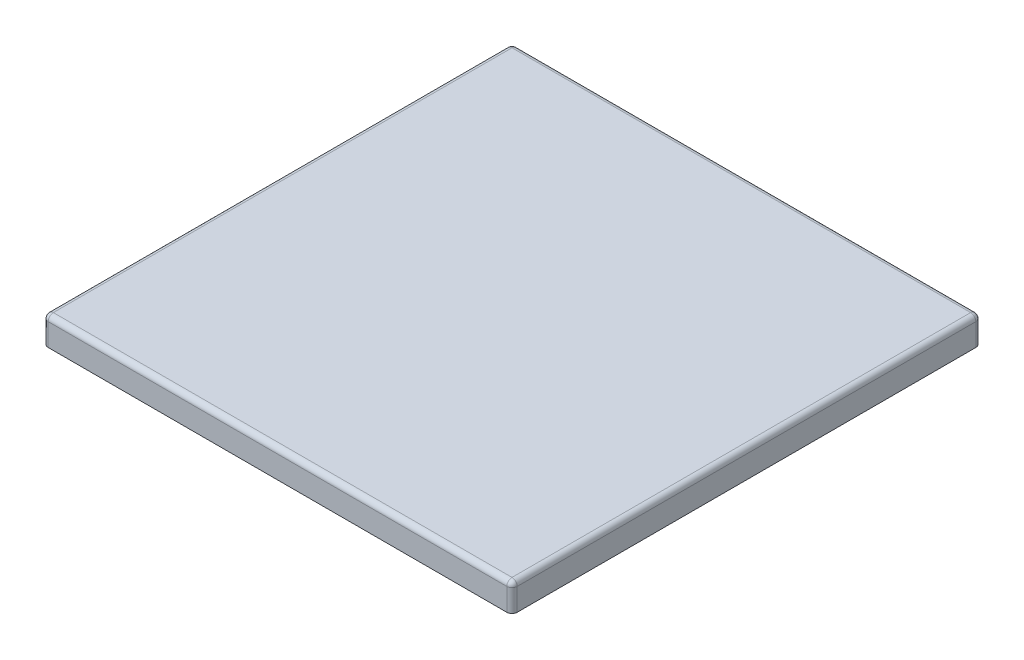
ISO-10303-21;
HEADER;
FILE_DESCRIPTION(('STEP AP214'),'2;1');
FILE_NAME('part.step','',(''),(''),'','','');
FILE_SCHEMA(('AUTOMOTIVE_DESIGN { 1 0 10303 214 1 1 1 1 }'));
ENDSEC;
DATA;
#1=APPLICATION_CONTEXT('core data for automotive mechanical design processes');
#2=APPLICATION_PROTOCOL_DEFINITION('international standard','automotive_design',2000,#1);
#3=PRODUCT_CONTEXT('',#1,'mechanical');
#4=PRODUCT('Part','Part','',(#3));
#5=PRODUCT_RELATED_PRODUCT_CATEGORY('part','',(#4));
#6=PRODUCT_DEFINITION_FORMATION('','',#4);
#7=PRODUCT_DEFINITION_CONTEXT('part definition',#1,'design');
#8=PRODUCT_DEFINITION('design','',#6,#7);
#9=PRODUCT_DEFINITION_SHAPE('','',#8);
#10=(LENGTH_UNIT() NAMED_UNIT(*) SI_UNIT(.MILLI.,.METRE.));
#11=(NAMED_UNIT(*) PLANE_ANGLE_UNIT() SI_UNIT($,.RADIAN.));
#12=(NAMED_UNIT(*) SI_UNIT($,.STERADIAN.) SOLID_ANGLE_UNIT());
#13=UNCERTAINTY_MEASURE_WITH_UNIT(LENGTH_MEASURE(1.E-05),#10,'distance_accuracy_value','');
#14=(GEOMETRIC_REPRESENTATION_CONTEXT(3) GLOBAL_UNCERTAINTY_ASSIGNED_CONTEXT((#13)) GLOBAL_UNIT_ASSIGNED_CONTEXT((#10,
#11,#12)) REPRESENTATION_CONTEXT('',''));
#15=CARTESIAN_POINT('',(0.,0.,0.));
#16=DIRECTION('',(0.,0.,1.));
#17=DIRECTION('',(1.,0.,0.));
#18=AXIS2_PLACEMENT_3D('',#15,#16,#17);
#19=CARTESIAN_POINT('',(0.,-3.3,0.));
#20=DIRECTION('',(0.,-1.,0.));
#21=DIRECTION('',(0.,0.,-1.));
#22=AXIS2_PLACEMENT_3D('',#19,#20,#21);
#23=PLANE('',#22);
#24=CARTESIAN_POINT('',(22.6,-3.3,22.4));
#25=DIRECTION('',(0.,-1.,0.));
#26=DIRECTION('',(0.,0.,-1.));
#27=AXIS2_PLACEMENT_3D('',#24,#25,#26);
#28=CIRCLE('',#27,6.1);
#29=CARTESIAN_POINT('',(22.6,-3.3,16.3));
#30=VERTEX_POINT('',#29);
#31=EDGE_CURVE('E438',#30,#30,#28,.T.);
#32=ORIENTED_EDGE('',*,*,#31,.F.);
#33=EDGE_LOOP('',(#32));
#34=FACE_BOUND('',#33,.T.);
#35=CARTESIAN_POINT('',(-22.4,-3.3,22.4));
#36=DIRECTION('',(0.,-1.,0.));
#37=DIRECTION('',(0.,0.,-1.));
#38=AXIS2_PLACEMENT_3D('',#35,#36,#37);
#39=CIRCLE('',#38,6.1);
#40=CARTESIAN_POINT('',(-22.4,-3.3,16.3));
#41=VERTEX_POINT('',#40);
#42=EDGE_CURVE('E147',#41,#41,#39,.T.);
#43=ORIENTED_EDGE('',*,*,#42,.F.);
#44=EDGE_LOOP('',(#43));
#45=FACE_BOUND('',#44,.T.);
#46=DIRECTION('',(0.,0.,-1.));
#47=VECTOR('',#46,1.);
#48=CARTESIAN_POINT('',(-43.,-3.3,43.));
#49=LINE('',#48,#47);
#50=CARTESIAN_POINT('',(-43.,-3.3,43.));
#51=VERTEX_POINT('',#50);
#52=CARTESIAN_POINT('',(-43.,-3.3,-43.));
#53=VERTEX_POINT('',#52);
#54=EDGE_CURVE('E121',#51,#53,#49,.T.);
#55=ORIENTED_EDGE('',*,*,#54,.T.);
#56=DIRECTION('',(1.,0.,0.));
#57=VECTOR('',#56,1.);
#58=CARTESIAN_POINT('',(-43.,-3.3,-43.));
#59=LINE('',#58,#57);
#60=CARTESIAN_POINT('',(43.,-3.3,-43.));
#61=VERTEX_POINT('',#60);
#62=EDGE_CURVE('E132',#53,#61,#59,.T.);
#63=ORIENTED_EDGE('',*,*,#62,.T.);
#64=DIRECTION('',(0.,0.,1.));
#65=VECTOR('',#64,1.);
#66=CARTESIAN_POINT('',(43.,-3.3,43.));
#67=LINE('',#66,#65);
#68=CARTESIAN_POINT('',(43.,-3.3,43.));
#69=VERTEX_POINT('',#68);
#70=EDGE_CURVE('E137',#61,#69,#67,.T.);
#71=ORIENTED_EDGE('',*,*,#70,.T.);
#72=DIRECTION('',(-1.,0.,0.));
#73=VECTOR('',#72,1.);
#74=CARTESIAN_POINT('',(-43.,-3.3,43.));
#75=LINE('',#74,#73);
#76=EDGE_CURVE('E129',#69,#51,#75,.T.);
#77=ORIENTED_EDGE('',*,*,#76,.T.);
#78=EDGE_LOOP('',(#55,#63,#71,#77));
#79=FACE_BOUND('',#78,.T.);
#80=CARTESIAN_POINT('',(-22.4,-3.3,-22.6));
#81=DIRECTION('',(0.,-1.,0.));
#82=DIRECTION('',(0.,0.,-1.));
#83=AXIS2_PLACEMENT_3D('',#80,#81,#82);
#84=CIRCLE('',#83,6.1);
#85=CARTESIAN_POINT('',(-22.4,-3.3,-28.7));
#86=VERTEX_POINT('',#85);
#87=EDGE_CURVE('E434',#86,#86,#84,.T.);
#88=ORIENTED_EDGE('',*,*,#87,.F.);
#89=EDGE_LOOP('',(#88));
#90=FACE_BOUND('',#89,.T.);
#91=CARTESIAN_POINT('',(22.6,-3.3,-22.6));
#92=DIRECTION('',(0.,-1.,0.));
#93=DIRECTION('',(0.,0.,-1.));
#94=AXIS2_PLACEMENT_3D('',#91,#92,#93);
#95=CIRCLE('',#94,6.1);
#96=CARTESIAN_POINT('',(22.6,-3.3,-28.7));
#97=VERTEX_POINT('',#96);
#98=EDGE_CURVE('E443',#97,#97,#95,.T.);
#99=ORIENTED_EDGE('',*,*,#98,.F.);
#100=EDGE_LOOP('',(#99));
#101=FACE_BOUND('',#100,.T.);
#102=ADVANCED_FACE('F16',(#34,#45,#79,#90,#101),#23,.T.);
#103=CARTESIAN_POINT('',(-45.,-5.3,-45.));
#104=DIRECTION('',(-1.,0.,0.));
#105=DIRECTION('',(0.,0.,1.));
#106=AXIS2_PLACEMENT_3D('',#103,#104,#105);
#107=PLANE('',#106);
#108=DIRECTION('',(0.,0.,1.));
#109=VECTOR('',#108,1.);
#110=CARTESIAN_POINT('',(-45.,-1.,-45.));
#111=LINE('',#110,#109);
#112=CARTESIAN_POINT('',(-45.,-1.,44.));
#113=VERTEX_POINT('',#112);
#114=CARTESIAN_POINT('',(-45.,-1.,-44.));
#115=VERTEX_POINT('',#114);
#116=EDGE_CURVE('E31',#113,#115,#111,.F.);
#117=ORIENTED_EDGE('',*,*,#116,.T.);
#118=DIRECTION('',(0.,1.,0.));
#119=VECTOR('',#118,1.);
#120=CARTESIAN_POINT('',(-45.,-5.3,-44.));
#121=LINE('',#120,#119);
#122=CARTESIAN_POINT('',(-45.,-5.3,-44.));
#123=VERTEX_POINT('',#122);
#124=EDGE_CURVE('E204',#115,#123,#121,.F.);
#125=ORIENTED_EDGE('',*,*,#124,.T.);
#126=DIRECTION('',(0.,0.,1.));
#127=VECTOR('',#126,1.);
#128=CARTESIAN_POINT('',(-45.,-5.3,-45.));
#129=LINE('',#128,#127);
#130=CARTESIAN_POINT('',(-45.,-5.3,44.));
#131=VERTEX_POINT('',#130);
#132=EDGE_CURVE('E160',#123,#131,#129,.T.);
#133=ORIENTED_EDGE('',*,*,#132,.T.);
#134=DIRECTION('',(0.,1.,0.));
#135=VECTOR('',#134,1.);
#136=CARTESIAN_POINT('',(-45.,-5.3,44.));
#137=LINE('',#136,#135);
#138=EDGE_CURVE('E36',#131,#113,#137,.T.);
#139=ORIENTED_EDGE('',*,*,#138,.T.);
#140=EDGE_LOOP('',(#117,#125,#133,#139));
#141=FACE_BOUND('',#140,.T.);
#142=ADVANCED_FACE('F285',(#141),#107,.T.);
#143=CARTESIAN_POINT('',(-45.,-5.3,-45.));
#144=DIRECTION('',(0.,0.,-1.));
#145=DIRECTION('',(-1.,0.,0.));
#146=AXIS2_PLACEMENT_3D('',#143,#144,#145);
#147=PLANE('',#146);
#148=DIRECTION('',(-1.,0.,0.));
#149=VECTOR('',#148,1.);
#150=CARTESIAN_POINT('',(-45.,-5.3,-45.));
#151=LINE('',#150,#149);
#152=CARTESIAN_POINT('',(44.,-5.3,-45.));
#153=VERTEX_POINT('',#152);
#154=CARTESIAN_POINT('',(-44.,-5.3,-45.));
#155=VERTEX_POINT('',#154);
#156=EDGE_CURVE('E171',#153,#155,#151,.T.);
#157=ORIENTED_EDGE('',*,*,#156,.T.);
#158=DIRECTION('',(0.,1.,0.));
#159=VECTOR('',#158,1.);
#160=CARTESIAN_POINT('',(-44.,-5.3,-45.));
#161=LINE('',#160,#159);
#162=CARTESIAN_POINT('',(-44.,-1.,-45.));
#163=VERTEX_POINT('',#162);
#164=EDGE_CURVE('E188',#155,#163,#161,.T.);
#165=ORIENTED_EDGE('',*,*,#164,.T.);
#166=DIRECTION('',(-1.,0.,0.));
#167=VECTOR('',#166,1.);
#168=CARTESIAN_POINT('',(-45.,-1.,-45.));
#169=LINE('',#168,#167);
#170=CARTESIAN_POINT('',(44.,-1.,-45.));
#171=VERTEX_POINT('',#170);
#172=EDGE_CURVE('E185',#163,#171,#169,.F.);
#173=ORIENTED_EDGE('',*,*,#172,.T.);
#174=DIRECTION('',(0.,1.,0.));
#175=VECTOR('',#174,1.);
#176=CARTESIAN_POINT('',(44.,-5.3,-45.));
#177=LINE('',#176,#175);
#178=EDGE_CURVE('E183',#171,#153,#177,.F.);
#179=ORIENTED_EDGE('',*,*,#178,.T.);
#180=EDGE_LOOP('',(#157,#165,#173,#179));
#181=FACE_BOUND('',#180,.T.);
#182=ADVANCED_FACE('F291',(#181),#147,.T.);
#183=CARTESIAN_POINT('',(45.,-5.3,-45.));
#184=DIRECTION('',(1.,0.,0.));
#185=DIRECTION('',(0.,0.,-1.));
#186=AXIS2_PLACEMENT_3D('',#183,#184,#185);
#187=PLANE('',#186);
#188=DIRECTION('',(0.,0.,-1.));
#189=VECTOR('',#188,1.);
#190=CARTESIAN_POINT('',(45.,-5.3,-45.));
#191=LINE('',#190,#189);
#192=CARTESIAN_POINT('',(45.,-5.3,44.));
#193=VERTEX_POINT('',#192);
#194=CARTESIAN_POINT('',(45.,-5.3,-44.));
#195=VERTEX_POINT('',#194);
#196=EDGE_CURVE('E168',#193,#195,#191,.T.);
#197=ORIENTED_EDGE('',*,*,#196,.T.);
#198=DIRECTION('',(0.,1.,0.));
#199=VECTOR('',#198,1.);
#200=CARTESIAN_POINT('',(45.,-5.3,-44.));
#201=LINE('',#200,#199);
#202=CARTESIAN_POINT('',(45.,-1.,-44.));
#203=VERTEX_POINT('',#202);
#204=EDGE_CURVE('E194',#195,#203,#201,.T.);
#205=ORIENTED_EDGE('',*,*,#204,.T.);
#206=DIRECTION('',(0.,0.,-1.));
#207=VECTOR('',#206,1.);
#208=CARTESIAN_POINT('',(45.,-1.,-45.));
#209=LINE('',#208,#207);
#210=CARTESIAN_POINT('',(45.,-1.,44.));
#211=VERTEX_POINT('',#210);
#212=EDGE_CURVE('E192',#203,#211,#209,.F.);
#213=ORIENTED_EDGE('',*,*,#212,.T.);
#214=DIRECTION('',(0.,1.,0.));
#215=VECTOR('',#214,1.);
#216=CARTESIAN_POINT('',(45.,-5.3,44.));
#217=LINE('',#216,#215);
#218=EDGE_CURVE('E190',#211,#193,#217,.F.);
#219=ORIENTED_EDGE('',*,*,#218,.T.);
#220=EDGE_LOOP('',(#197,#205,#213,#219));
#221=FACE_BOUND('',#220,.T.);
#222=ADVANCED_FACE('F323',(#221),#187,.T.);
#223=CARTESIAN_POINT('',(-45.,-5.3,45.));
#224=DIRECTION('',(0.,0.,1.));
#225=DIRECTION('',(1.,0.,0.));
#226=AXIS2_PLACEMENT_3D('',#223,#224,#225);
#227=PLANE('',#226);
#228=DIRECTION('',(1.,0.,0.));
#229=VECTOR('',#228,1.);
#230=CARTESIAN_POINT('',(-45.,-1.,45.));
#231=LINE('',#230,#229);
#232=CARTESIAN_POINT('',(44.,-1.,45.));
#233=VERTEX_POINT('',#232);
#234=CARTESIAN_POINT('',(-44.,-1.,45.));
#235=VERTEX_POINT('',#234);
#236=EDGE_CURVE('E198',#233,#235,#231,.F.);
#237=ORIENTED_EDGE('',*,*,#236,.T.);
#238=DIRECTION('',(0.,1.,0.));
#239=VECTOR('',#238,1.);
#240=CARTESIAN_POINT('',(-44.,-5.3,45.));
#241=LINE('',#240,#239);
#242=CARTESIAN_POINT('',(-44.,-5.3,45.));
#243=VERTEX_POINT('',#242);
#244=EDGE_CURVE('E200',#235,#243,#241,.F.);
#245=ORIENTED_EDGE('',*,*,#244,.T.);
#246=DIRECTION('',(1.,0.,0.));
#247=VECTOR('',#246,1.);
#248=CARTESIAN_POINT('',(-45.,-5.3,45.));
#249=LINE('',#248,#247);
#250=CARTESIAN_POINT('',(44.,-5.3,45.));
#251=VERTEX_POINT('',#250);
#252=EDGE_CURVE('E165',#243,#251,#249,.T.);
#253=ORIENTED_EDGE('',*,*,#252,.T.);
#254=DIRECTION('',(0.,1.,0.));
#255=VECTOR('',#254,1.);
#256=CARTESIAN_POINT('',(44.,-5.3,45.));
#257=LINE('',#256,#255);
#258=EDGE_CURVE('E196',#251,#233,#257,.T.);
#259=ORIENTED_EDGE('',*,*,#258,.T.);
#260=EDGE_LOOP('',(#237,#245,#253,#259));
#261=FACE_BOUND('',#260,.T.);
#262=ADVANCED_FACE('F316',(#261),#227,.T.);
#263=CARTESIAN_POINT('',(0.,-5.3,0.));
#264=DIRECTION('',(0.,1.,0.));
#265=DIRECTION('',(0.,0.,1.));
#266=AXIS2_PLACEMENT_3D('',#263,#264,#265);
#267=PLANE('',#266);
#268=DIRECTION('',(1.,0.,0.));
#269=VECTOR('',#268,1.);
#270=CARTESIAN_POINT('',(-43.,-5.3,-43.));
#271=LINE('',#270,#269);
#272=CARTESIAN_POINT('',(-43.,-5.3,-43.));
#273=VERTEX_POINT('',#272);
#274=CARTESIAN_POINT('',(43.,-5.3,-43.));
#275=VERTEX_POINT('',#274);
#276=EDGE_CURVE('E153',#273,#275,#271,.T.);
#277=ORIENTED_EDGE('',*,*,#276,.F.);
#278=DIRECTION('',(0.,0.,-1.));
#279=VECTOR('',#278,1.);
#280=CARTESIAN_POINT('',(-43.,-5.3,43.));
#281=LINE('',#280,#279);
#282=CARTESIAN_POINT('',(-43.,-5.3,43.));
#283=VERTEX_POINT('',#282);
#284=EDGE_CURVE('E124',#283,#273,#281,.T.);
#285=ORIENTED_EDGE('',*,*,#284,.F.);
#286=DIRECTION('',(-1.,0.,0.));
#287=VECTOR('',#286,1.);
#288=CARTESIAN_POINT('',(-43.,-5.3,43.));
#289=LINE('',#288,#287);
#290=CARTESIAN_POINT('',(43.,-5.3,43.));
#291=VERTEX_POINT('',#290);
#292=EDGE_CURVE('E141',#291,#283,#289,.T.);
#293=ORIENTED_EDGE('',*,*,#292,.F.);
#294=DIRECTION('',(0.,0.,1.));
#295=VECTOR('',#294,1.);
#296=CARTESIAN_POINT('',(43.,-5.3,43.));
#297=LINE('',#296,#295);
#298=EDGE_CURVE('E144',#275,#291,#297,.T.);
#299=ORIENTED_EDGE('',*,*,#298,.F.);
#300=EDGE_LOOP('',(#277,#285,#293,#299));
#301=FACE_BOUND('',#300,.T.);
#302=ORIENTED_EDGE('',*,*,#132,.F.);
#303=CARTESIAN_POINT('',(-44.,-5.3,-44.));
#304=DIRECTION('',(0.,1.,0.));
#305=DIRECTION('',(0.,0.,1.));
#306=AXIS2_PLACEMENT_3D('',#303,#304,#305);
#307=CIRCLE('',#306,1.);
#308=EDGE_CURVE('E212',#123,#155,#307,.F.);
#309=ORIENTED_EDGE('',*,*,#308,.T.);
#310=ORIENTED_EDGE('',*,*,#156,.F.);
#311=CARTESIAN_POINT('',(44.,-5.3,-44.));
#312=DIRECTION('',(0.,1.,0.));
#313=DIRECTION('',(0.,0.,1.));
#314=AXIS2_PLACEMENT_3D('',#311,#312,#313);
#315=CIRCLE('',#314,1.);
#316=EDGE_CURVE('E208',#153,#195,#315,.F.);
#317=ORIENTED_EDGE('',*,*,#316,.T.);
#318=ORIENTED_EDGE('',*,*,#196,.F.);
#319=CARTESIAN_POINT('',(44.,-5.3,44.));
#320=DIRECTION('',(0.,1.,0.));
#321=DIRECTION('',(0.,0.,1.));
#322=AXIS2_PLACEMENT_3D('',#319,#320,#321);
#323=CIRCLE('',#322,1.);
#324=EDGE_CURVE('E206',#193,#251,#323,.F.);
#325=ORIENTED_EDGE('',*,*,#324,.T.);
#326=ORIENTED_EDGE('',*,*,#252,.F.);
#327=CARTESIAN_POINT('',(-44.,-5.3,44.));
#328=DIRECTION('',(0.,1.,0.));
#329=DIRECTION('',(0.,0.,1.));
#330=AXIS2_PLACEMENT_3D('',#327,#328,#329);
#331=CIRCLE('',#330,1.);
#332=EDGE_CURVE('E210',#243,#131,#331,.F.);
#333=ORIENTED_EDGE('',*,*,#332,.T.);
#334=EDGE_LOOP('',(#302,#309,#310,#317,#318,#325,#326,#333));
#335=FACE_BOUND('',#334,.T.);
#336=ADVANCED_FACE('F313',(#301,#335),#267,.F.);
#337=CARTESIAN_POINT('',(0.,0.,0.));
#338=DIRECTION('',(0.,1.,0.));
#339=DIRECTION('',(0.,0.,1.));
#340=AXIS2_PLACEMENT_3D('',#337,#338,#339);
#341=PLANE('',#340);
#342=DIRECTION('',(0.,0.,-1.));
#343=VECTOR('',#342,1.);
#344=CARTESIAN_POINT('',(44.,0.,0.));
#345=LINE('',#344,#343);
#346=CARTESIAN_POINT('',(44.,0.,44.));
#347=VERTEX_POINT('',#346);
#348=CARTESIAN_POINT('',(44.,0.,-44.));
#349=VERTEX_POINT('',#348);
#350=EDGE_CURVE('E178',#347,#349,#345,.T.);
#351=ORIENTED_EDGE('',*,*,#350,.T.);
#352=DIRECTION('',(-1.,0.,0.));
#353=VECTOR('',#352,1.);
#354=CARTESIAN_POINT('',(0.,0.,-44.));
#355=LINE('',#354,#353);
#356=CARTESIAN_POINT('',(-44.,0.,-44.));
#357=VERTEX_POINT('',#356);
#358=EDGE_CURVE('E180',#349,#357,#355,.T.);
#359=ORIENTED_EDGE('',*,*,#358,.T.);
#360=DIRECTION('',(0.,0.,1.));
#361=VECTOR('',#360,1.);
#362=CARTESIAN_POINT('',(-44.,0.,0.));
#363=LINE('',#362,#361);
#364=CARTESIAN_POINT('',(-44.,0.,44.));
#365=VERTEX_POINT('',#364);
#366=EDGE_CURVE('E174',#357,#365,#363,.T.);
#367=ORIENTED_EDGE('',*,*,#366,.T.);
#368=DIRECTION('',(1.,0.,0.));
#369=VECTOR('',#368,1.);
#370=CARTESIAN_POINT('',(0.,0.,44.));
#371=LINE('',#370,#369);
#372=EDGE_CURVE('E176',#365,#347,#371,.T.);
#373=ORIENTED_EDGE('',*,*,#372,.T.);
#374=EDGE_LOOP('',(#351,#359,#367,#373));
#375=FACE_BOUND('',#374,.T.);
#376=ADVANCED_FACE('F312',(#375),#341,.T.);
#377=CARTESIAN_POINT('',(-43.,-3.3,43.));
#378=DIRECTION('',(-1.,0.,0.));
#379=DIRECTION('',(0.,0.,1.));
#380=AXIS2_PLACEMENT_3D('',#377,#378,#379);
#381=PLANE('',#380);
#382=ORIENTED_EDGE('',*,*,#284,.T.);
#383=DIRECTION('',(0.,-1.,0.));
#384=VECTOR('',#383,1.);
#385=CARTESIAN_POINT('',(-43.,-3.3,-43.));
#386=LINE('',#385,#384);
#387=EDGE_CURVE('E117',#53,#273,#386,.T.);
#388=ORIENTED_EDGE('',*,*,#387,.F.);
#389=ORIENTED_EDGE('',*,*,#54,.F.);
#390=DIRECTION('',(0.,-1.,0.));
#391=VECTOR('',#390,1.);
#392=CARTESIAN_POINT('',(-43.,-3.3,43.));
#393=LINE('',#392,#391);
#394=EDGE_CURVE('E158',#51,#283,#393,.T.);
#395=ORIENTED_EDGE('',*,*,#394,.T.);
#396=EDGE_LOOP('',(#382,#388,#389,#395));
#397=FACE_BOUND('',#396,.T.);
#398=ADVANCED_FACE('F119',(#397),#381,.F.);
#399=CARTESIAN_POINT('',(-43.,-3.3,43.));
#400=DIRECTION('',(0.,0.,1.));
#401=DIRECTION('',(1.,0.,0.));
#402=AXIS2_PLACEMENT_3D('',#399,#400,#401);
#403=PLANE('',#402);
#404=ORIENTED_EDGE('',*,*,#292,.T.);
#405=ORIENTED_EDGE('',*,*,#394,.F.);
#406=ORIENTED_EDGE('',*,*,#76,.F.);
#407=DIRECTION('',(0.,-1.,0.));
#408=VECTOR('',#407,1.);
#409=CARTESIAN_POINT('',(43.,-3.3,43.));
#410=LINE('',#409,#408);
#411=EDGE_CURVE('E161',#69,#291,#410,.T.);
#412=ORIENTED_EDGE('',*,*,#411,.T.);
#413=EDGE_LOOP('',(#404,#405,#406,#412));
#414=FACE_BOUND('',#413,.T.);
#415=ADVANCED_FACE('F299',(#414),#403,.F.);
#416=CARTESIAN_POINT('',(43.,-3.3,43.));
#417=DIRECTION('',(1.,0.,0.));
#418=DIRECTION('',(0.,0.,-1.));
#419=AXIS2_PLACEMENT_3D('',#416,#417,#418);
#420=PLANE('',#419);
#421=ORIENTED_EDGE('',*,*,#298,.T.);
#422=ORIENTED_EDGE('',*,*,#411,.F.);
#423=ORIENTED_EDGE('',*,*,#70,.F.);
#424=DIRECTION('',(0.,-1.,0.));
#425=VECTOR('',#424,1.);
#426=CARTESIAN_POINT('',(43.,-3.3,-43.));
#427=LINE('',#426,#425);
#428=EDGE_CURVE('E128',#61,#275,#427,.T.);
#429=ORIENTED_EDGE('',*,*,#428,.T.);
#430=EDGE_LOOP('',(#421,#422,#423,#429));
#431=FACE_BOUND('',#430,.T.);
#432=ADVANCED_FACE('F302',(#431),#420,.F.);
#433=CARTESIAN_POINT('',(-43.,-3.3,-43.));
#434=DIRECTION('',(0.,0.,-1.));
#435=DIRECTION('',(-1.,0.,0.));
#436=AXIS2_PLACEMENT_3D('',#433,#434,#435);
#437=PLANE('',#436);
#438=ORIENTED_EDGE('',*,*,#276,.T.);
#439=ORIENTED_EDGE('',*,*,#428,.F.);
#440=ORIENTED_EDGE('',*,*,#62,.F.);
#441=ORIENTED_EDGE('',*,*,#387,.T.);
#442=EDGE_LOOP('',(#438,#439,#440,#441));
#443=FACE_BOUND('',#442,.T.);
#444=ADVANCED_FACE('F133',(#443),#437,.F.);
#445=CARTESIAN_POINT('',(44.,-5.3,44.));
#446=DIRECTION('',(0.,1.,0.));
#447=DIRECTION('',(0.,0.,1.));
#448=AXIS2_PLACEMENT_3D('',#445,#446,#447);
#449=CYLINDRICAL_SURFACE('',#448,1.);
#450=ORIENTED_EDGE('',*,*,#324,.F.);
#451=ORIENTED_EDGE('',*,*,#218,.F.);
#452=CARTESIAN_POINT('',(44.,-1.,44.));
#453=DIRECTION('',(0.,1.,0.));
#454=DIRECTION('',(0.,0.,1.));
#455=AXIS2_PLACEMENT_3D('',#452,#453,#454);
#456=CIRCLE('',#455,1.);
#457=EDGE_CURVE('E154',#233,#211,#456,.T.);
#458=ORIENTED_EDGE('',*,*,#457,.F.);
#459=ORIENTED_EDGE('',*,*,#258,.F.);
#460=EDGE_LOOP('',(#450,#451,#458,#459));
#461=FACE_BOUND('',#460,.T.);
#462=ADVANCED_FACE('F309',(#461),#449,.T.);
#463=CARTESIAN_POINT('',(0.,-1.,44.));
#464=DIRECTION('',(1.,0.,0.));
#465=DIRECTION('',(0.,0.,-1.));
#466=AXIS2_PLACEMENT_3D('',#463,#464,#465);
#467=CYLINDRICAL_SURFACE('',#466,1.);
#468=CARTESIAN_POINT('',(-44.,-1.,44.));
#469=DIRECTION('',(-1.,0.,0.));
#470=DIRECTION('',(0.,0.,1.));
#471=AXIS2_PLACEMENT_3D('',#468,#469,#470);
#472=CIRCLE('',#471,1.);
#473=EDGE_CURVE('E240',#235,#365,#472,.T.);
#474=ORIENTED_EDGE('',*,*,#473,.F.);
#475=ORIENTED_EDGE('',*,*,#236,.F.);
#476=CARTESIAN_POINT('',(44.,-1.,44.));
#477=DIRECTION('',(1.,0.,0.));
#478=DIRECTION('',(0.,0.,-1.));
#479=AXIS2_PLACEMENT_3D('',#476,#477,#478);
#480=CIRCLE('',#479,1.);
#481=EDGE_CURVE('E243',#347,#233,#480,.T.);
#482=ORIENTED_EDGE('',*,*,#481,.F.);
#483=ORIENTED_EDGE('',*,*,#372,.F.);
#484=EDGE_LOOP('',(#474,#475,#482,#483));
#485=FACE_BOUND('',#484,.T.);
#486=ADVANCED_FACE('F370',(#485),#467,.T.);
#487=CARTESIAN_POINT('',(-44.,-5.3,44.));
#488=DIRECTION('',(0.,1.,0.));
#489=DIRECTION('',(0.,0.,1.));
#490=AXIS2_PLACEMENT_3D('',#487,#488,#489);
#491=CYLINDRICAL_SURFACE('',#490,1.);
#492=ORIENTED_EDGE('',*,*,#332,.F.);
#493=ORIENTED_EDGE('',*,*,#244,.F.);
#494=CARTESIAN_POINT('',(-44.,-1.,44.));
#495=DIRECTION('',(0.,1.,0.));
#496=DIRECTION('',(0.,0.,1.));
#497=AXIS2_PLACEMENT_3D('',#494,#495,#496);
#498=CIRCLE('',#497,1.);
#499=EDGE_CURVE('E237',#113,#235,#498,.T.);
#500=ORIENTED_EDGE('',*,*,#499,.F.);
#501=ORIENTED_EDGE('',*,*,#138,.F.);
#502=EDGE_LOOP('',(#492,#493,#500,#501));
#503=FACE_BOUND('',#502,.T.);
#504=ADVANCED_FACE('F366',(#503),#491,.T.);
#505=CARTESIAN_POINT('',(44.,-1.,44.));
#506=DIRECTION('',(0.,0.,1.));
#507=DIRECTION('',(1.,0.,0.));
#508=AXIS2_PLACEMENT_3D('',#505,#506,#507);
#509=SPHERICAL_SURFACE('',#508,1.);
#510=ORIENTED_EDGE('',*,*,#481,.T.);
#511=ORIENTED_EDGE('',*,*,#457,.T.);
#512=CARTESIAN_POINT('',(44.,-1.,44.));
#513=DIRECTION('',(0.,0.,1.));
#514=DIRECTION('',(1.,0.,0.));
#515=AXIS2_PLACEMENT_3D('',#512,#513,#514);
#516=CIRCLE('',#515,1.);
#517=EDGE_CURVE('E234',#347,#211,#516,.F.);
#518=ORIENTED_EDGE('',*,*,#517,.F.);
#519=EDGE_LOOP('',(#510,#511,#518));
#520=FACE_BOUND('',#519,.T.);
#521=ADVANCED_FACE('F362',(#520),#509,.T.);
#522=CARTESIAN_POINT('',(-44.,-1.,44.));
#523=DIRECTION('',(0.,0.,1.));
#524=DIRECTION('',(1.,0.,0.));
#525=AXIS2_PLACEMENT_3D('',#522,#523,#524);
#526=SPHERICAL_SURFACE('',#525,1.);
#527=ORIENTED_EDGE('',*,*,#499,.T.);
#528=ORIENTED_EDGE('',*,*,#473,.T.);
#529=CARTESIAN_POINT('',(-44.,-1.,44.));
#530=DIRECTION('',(0.,0.,1.));
#531=DIRECTION('',(1.,0.,0.));
#532=AXIS2_PLACEMENT_3D('',#529,#530,#531);
#533=CIRCLE('',#532,1.);
#534=EDGE_CURVE('E231',#113,#365,#533,.F.);
#535=ORIENTED_EDGE('',*,*,#534,.F.);
#536=EDGE_LOOP('',(#527,#528,#535));
#537=FACE_BOUND('',#536,.T.);
#538=ADVANCED_FACE('F358',(#537),#526,.T.);
#539=CARTESIAN_POINT('',(44.,-5.3,-44.));
#540=DIRECTION('',(0.,1.,0.));
#541=DIRECTION('',(0.,0.,1.));
#542=AXIS2_PLACEMENT_3D('',#539,#540,#541);
#543=CYLINDRICAL_SURFACE('',#542,1.);
#544=ORIENTED_EDGE('',*,*,#316,.F.);
#545=ORIENTED_EDGE('',*,*,#178,.F.);
#546=CARTESIAN_POINT('',(44.,-1.,-44.));
#547=DIRECTION('',(0.,1.,0.));
#548=DIRECTION('',(0.,0.,1.));
#549=AXIS2_PLACEMENT_3D('',#546,#547,#548);
#550=CIRCLE('',#549,1.);
#551=EDGE_CURVE('E228',#203,#171,#550,.T.);
#552=ORIENTED_EDGE('',*,*,#551,.F.);
#553=ORIENTED_EDGE('',*,*,#204,.F.);
#554=EDGE_LOOP('',(#544,#545,#552,#553));
#555=FACE_BOUND('',#554,.T.);
#556=ADVANCED_FACE('F354',(#555),#543,.T.);
#557=CARTESIAN_POINT('',(44.,-1.,0.));
#558=DIRECTION('',(0.,0.,-1.));
#559=DIRECTION('',(-1.,0.,0.));
#560=AXIS2_PLACEMENT_3D('',#557,#558,#559);
#561=CYLINDRICAL_SURFACE('',#560,1.);
#562=ORIENTED_EDGE('',*,*,#517,.T.);
#563=ORIENTED_EDGE('',*,*,#212,.F.);
#564=CARTESIAN_POINT('',(44.,-1.,-44.));
#565=DIRECTION('',(0.,0.,-1.));
#566=DIRECTION('',(-1.,0.,0.));
#567=AXIS2_PLACEMENT_3D('',#564,#565,#566);
#568=CIRCLE('',#567,1.);
#569=EDGE_CURVE('E225',#349,#203,#568,.T.);
#570=ORIENTED_EDGE('',*,*,#569,.F.);
#571=ORIENTED_EDGE('',*,*,#350,.F.);
#572=EDGE_LOOP('',(#562,#563,#570,#571));
#573=FACE_BOUND('',#572,.T.);
#574=ADVANCED_FACE('F350',(#573),#561,.T.);
#575=CARTESIAN_POINT('',(-44.,-1.,0.));
#576=DIRECTION('',(0.,0.,1.));
#577=DIRECTION('',(1.,0.,0.));
#578=AXIS2_PLACEMENT_3D('',#575,#576,#577);
#579=CYLINDRICAL_SURFACE('',#578,1.);
#580=ORIENTED_EDGE('',*,*,#534,.T.);
#581=ORIENTED_EDGE('',*,*,#366,.F.);
#582=CARTESIAN_POINT('',(-44.,-1.,-44.));
#583=DIRECTION('',(0.,0.,-1.));
#584=DIRECTION('',(-1.,0.,0.));
#585=AXIS2_PLACEMENT_3D('',#582,#583,#584);
#586=CIRCLE('',#585,1.);
#587=EDGE_CURVE('E222',#115,#357,#586,.T.);
#588=ORIENTED_EDGE('',*,*,#587,.F.);
#589=ORIENTED_EDGE('',*,*,#116,.F.);
#590=EDGE_LOOP('',(#580,#581,#588,#589));
#591=FACE_BOUND('',#590,.T.);
#592=ADVANCED_FACE('F346',(#591),#579,.T.);
#593=CARTESIAN_POINT('',(-44.,-5.3,-44.));
#594=DIRECTION('',(0.,1.,0.));
#595=DIRECTION('',(0.,0.,1.));
#596=AXIS2_PLACEMENT_3D('',#593,#594,#595);
#597=CYLINDRICAL_SURFACE('',#596,1.);
#598=ORIENTED_EDGE('',*,*,#308,.F.);
#599=ORIENTED_EDGE('',*,*,#124,.F.);
#600=CARTESIAN_POINT('',(-44.,-1.,-44.));
#601=DIRECTION('',(0.,1.,0.));
#602=DIRECTION('',(0.,0.,1.));
#603=AXIS2_PLACEMENT_3D('',#600,#601,#602);
#604=CIRCLE('',#603,1.);
#605=EDGE_CURVE('E219',#163,#115,#604,.T.);
#606=ORIENTED_EDGE('',*,*,#605,.F.);
#607=ORIENTED_EDGE('',*,*,#164,.F.);
#608=EDGE_LOOP('',(#598,#599,#606,#607));
#609=FACE_BOUND('',#608,.T.);
#610=ADVANCED_FACE('F342',(#609),#597,.T.);
#611=CARTESIAN_POINT('',(44.,-1.,-44.));
#612=DIRECTION('',(0.,0.,1.));
#613=DIRECTION('',(1.,0.,0.));
#614=AXIS2_PLACEMENT_3D('',#611,#612,#613);
#615=SPHERICAL_SURFACE('',#614,1.);
#616=ORIENTED_EDGE('',*,*,#569,.T.);
#617=ORIENTED_EDGE('',*,*,#551,.T.);
#618=CARTESIAN_POINT('',(44.,-1.,-44.));
#619=DIRECTION('',(1.,0.,0.));
#620=DIRECTION('',(0.,1.,0.));
#621=AXIS2_PLACEMENT_3D('',#618,#619,#620);
#622=CIRCLE('',#621,1.);
#623=EDGE_CURVE('E217',#349,#171,#622,.F.);
#624=ORIENTED_EDGE('',*,*,#623,.F.);
#625=EDGE_LOOP('',(#616,#617,#624));
#626=FACE_BOUND('',#625,.T.);
#627=ADVANCED_FACE('F338',(#626),#615,.T.);
#628=CARTESIAN_POINT('',(-44.,-1.,-44.));
#629=DIRECTION('',(0.,0.,1.));
#630=DIRECTION('',(1.,0.,0.));
#631=AXIS2_PLACEMENT_3D('',#628,#629,#630);
#632=SPHERICAL_SURFACE('',#631,1.);
#633=ORIENTED_EDGE('',*,*,#605,.T.);
#634=ORIENTED_EDGE('',*,*,#587,.T.);
#635=CARTESIAN_POINT('',(-44.,-1.,-44.));
#636=DIRECTION('',(-1.,0.,0.));
#637=DIRECTION('',(0.,0.,1.));
#638=AXIS2_PLACEMENT_3D('',#635,#636,#637);
#639=CIRCLE('',#638,1.);
#640=EDGE_CURVE('E215',#163,#357,#639,.F.);
#641=ORIENTED_EDGE('',*,*,#640,.F.);
#642=EDGE_LOOP('',(#633,#634,#641));
#643=FACE_BOUND('',#642,.T.);
#644=ADVANCED_FACE('F334',(#643),#632,.T.);
#645=CARTESIAN_POINT('',(0.,-1.,-44.));
#646=DIRECTION('',(-1.,0.,0.));
#647=DIRECTION('',(0.,0.,1.));
#648=AXIS2_PLACEMENT_3D('',#645,#646,#647);
#649=CYLINDRICAL_SURFACE('',#648,1.);
#650=ORIENTED_EDGE('',*,*,#623,.T.);
#651=ORIENTED_EDGE('',*,*,#172,.F.);
#652=ORIENTED_EDGE('',*,*,#640,.T.);
#653=ORIENTED_EDGE('',*,*,#358,.F.);
#654=EDGE_LOOP('',(#650,#651,#652,#653));
#655=FACE_BOUND('',#654,.T.);
#656=ADVANCED_FACE('F331',(#655),#649,.T.);
#657=CARTESIAN_POINT('',(-22.4,-13.6,22.4));
#658=DIRECTION('',(0.,1.,0.));
#659=DIRECTION('',(0.,0.,1.));
#660=AXIS2_PLACEMENT_3D('',#657,#658,#659);
#661=CYLINDRICAL_SURFACE('',#660,6.1);
#662=CARTESIAN_POINT('',(-22.4,-8.40000000000043,22.4));
#663=DIRECTION('',(0.,-1.,0.));
#664=DIRECTION('',(0.,0.,-1.));
#665=AXIS2_PLACEMENT_3D('',#662,#663,#664);
#666=CIRCLE('',#665,6.1);
#667=CARTESIAN_POINT('',(-22.4,-8.40000000000043,16.3));
#668=VERTEX_POINT('',#667);
#669=EDGE_CURVE('E250',#668,#668,#666,.F.);
#670=ORIENTED_EDGE('',*,*,#669,.T.);
#671=EDGE_LOOP('',(#670));
#672=FACE_BOUND('',#671,.T.);
#673=ORIENTED_EDGE('',*,*,#42,.T.);
#674=EDGE_LOOP('',(#673));
#675=FACE_BOUND('',#674,.T.);
#676=ADVANCED_FACE('F297',(#672,#675),#661,.T.);
#677=CARTESIAN_POINT('',(-22.4,-13.6,22.4));
#678=DIRECTION('',(0.,-1.,0.));
#679=DIRECTION('',(0.,0.,-1.));
#680=AXIS2_PLACEMENT_3D('',#677,#678,#679);
#681=PLANE('',#680);
#682=CARTESIAN_POINT('',(-22.4,-13.6,22.4));
#683=DIRECTION('',(0.,-1.,0.));
#684=DIRECTION('',(0.,0.,-1.));
#685=AXIS2_PLACEMENT_3D('',#682,#683,#684);
#686=CIRCLE('',#685,4.4);
#687=CARTESIAN_POINT('',(-22.4,-13.6,18.));
#688=VERTEX_POINT('',#687);
#689=EDGE_CURVE('E429',#688,#688,#686,.T.);
#690=ORIENTED_EDGE('',*,*,#689,.F.);
#691=EDGE_LOOP('',(#690));
#692=FACE_BOUND('',#691,.T.);
#693=CARTESIAN_POINT('',(-22.4,-13.6,22.4));
#694=DIRECTION('',(0.,-1.,0.));
#695=DIRECTION('',(0.,0.,-1.));
#696=AXIS2_PLACEMENT_3D('',#693,#694,#695);
#697=CIRCLE('',#696,5.0000000000001);
#698=CARTESIAN_POINT('',(-22.4,-13.6,17.3999999999999));
#699=VERTEX_POINT('',#698);
#700=EDGE_CURVE('E214',#699,#699,#697,.T.);
#701=ORIENTED_EDGE('',*,*,#700,.T.);
#702=EDGE_LOOP('',(#701));
#703=FACE_BOUND('',#702,.T.);
#704=ADVANCED_FACE('F382',(#692,#703),#681,.T.);
#705=CARTESIAN_POINT('',(-22.4,-13.6,22.4));
#706=DIRECTION('',(0.,1.,0.));
#707=DIRECTION('',(0.,0.,1.));
#708=AXIS2_PLACEMENT_3D('',#705,#706,#707);
#709=CONICAL_SURFACE('',#708,5.0000000000001,0.208465218379986);
#710=ORIENTED_EDGE('',*,*,#669,.F.);
#711=EDGE_LOOP('',(#710));
#712=FACE_BOUND('',#711,.T.);
#713=ORIENTED_EDGE('',*,*,#700,.F.);
#714=EDGE_LOOP('',(#713));
#715=FACE_BOUND('',#714,.T.);
#716=ADVANCED_FACE('F378',(#712,#715),#709,.T.);
#717=CARTESIAN_POINT('',(-22.4,9.14507934888324,22.4));
#718=DIRECTION('',(0.,-1.,0.));
#719=DIRECTION('',(0.,0.,-1.));
#720=AXIS2_PLACEMENT_3D('',#717,#718,#719);
#721=CYLINDRICAL_SURFACE('',#720,4.4);
#722=CARTESIAN_POINT('',(-22.4,-3.3,22.4));
#723=DIRECTION('',(0.,-1.,0.));
#724=DIRECTION('',(0.,0.,-1.));
#725=AXIS2_PLACEMENT_3D('',#722,#723,#724);
#726=CIRCLE('',#725,4.4);
#727=CARTESIAN_POINT('',(-22.4,-3.3,18.));
#728=VERTEX_POINT('',#727);
#729=EDGE_CURVE('E433',#728,#728,#726,.F.);
#730=ORIENTED_EDGE('',*,*,#729,.T.);
#731=EDGE_LOOP('',(#730));
#732=FACE_BOUND('',#731,.T.);
#733=ORIENTED_EDGE('',*,*,#689,.T.);
#734=EDGE_LOOP('',(#733));
#735=FACE_BOUND('',#734,.T.);
#736=ADVANCED_FACE('F381',(#732,#735),#721,.F.);
#737=CARTESIAN_POINT('',(0.,-3.3,0.));
#738=DIRECTION('',(0.,-1.,0.));
#739=DIRECTION('',(0.,0.,-1.));
#740=AXIS2_PLACEMENT_3D('',#737,#738,#739);
#741=PLANE('',#740);
#742=ORIENTED_EDGE('',*,*,#729,.F.);
#743=EDGE_LOOP('',(#742));
#744=FACE_BOUND('',#743,.T.);
#745=ADVANCED_FACE('F409',(#744),#741,.T.);
#746=CARTESIAN_POINT('',(-22.4,-13.6,-22.6));
#747=DIRECTION('',(0.,1.,0.));
#748=DIRECTION('',(0.,0.,1.));
#749=AXIS2_PLACEMENT_3D('',#746,#747,#748);
#750=CYLINDRICAL_SURFACE('',#749,6.1);
#751=CARTESIAN_POINT('',(-22.4,-8.40000000000043,-22.6));
#752=DIRECTION('',(0.,-1.,0.));
#753=DIRECTION('',(0.,0.,-1.));
#754=AXIS2_PLACEMENT_3D('',#751,#752,#753);
#755=CIRCLE('',#754,6.1);
#756=CARTESIAN_POINT('',(-22.4,-8.40000000000043,-28.7));
#757=VERTEX_POINT('',#756);
#758=EDGE_CURVE('E256',#757,#757,#755,.F.);
#759=ORIENTED_EDGE('',*,*,#758,.T.);
#760=EDGE_LOOP('',(#759));
#761=FACE_BOUND('',#760,.T.);
#762=ORIENTED_EDGE('',*,*,#87,.T.);
#763=EDGE_LOOP('',(#762));
#764=FACE_BOUND('',#763,.T.);
#765=ADVANCED_FACE('F399',(#761,#764),#750,.T.);
#766=CARTESIAN_POINT('',(-22.4,-13.6,-22.6));
#767=DIRECTION('',(0.,-1.,0.));
#768=DIRECTION('',(0.,0.,-1.));
#769=AXIS2_PLACEMENT_3D('',#766,#767,#768);
#770=PLANE('',#769);
#771=CARTESIAN_POINT('',(-22.4,-13.6,-22.6));
#772=DIRECTION('',(0.,-1.,0.));
#773=DIRECTION('',(0.,0.,-1.));
#774=AXIS2_PLACEMENT_3D('',#771,#772,#773);
#775=CIRCLE('',#774,4.4);
#776=CARTESIAN_POINT('',(-22.4,-13.6,-27.));
#777=VERTEX_POINT('',#776);
#778=EDGE_CURVE('E449',#777,#777,#775,.T.);
#779=ORIENTED_EDGE('',*,*,#778,.F.);
#780=EDGE_LOOP('',(#779));
#781=FACE_BOUND('',#780,.T.);
#782=CARTESIAN_POINT('',(-22.4,-13.6,-22.6));
#783=DIRECTION('',(0.,-1.,0.));
#784=DIRECTION('',(0.,0.,-1.));
#785=AXIS2_PLACEMENT_3D('',#782,#783,#784);
#786=CIRCLE('',#785,5.0000000000001);
#787=CARTESIAN_POINT('',(-22.4,-13.6,-27.6000000000001));
#788=VERTEX_POINT('',#787);
#789=EDGE_CURVE('E253',#788,#788,#786,.T.);
#790=ORIENTED_EDGE('',*,*,#789,.T.);
#791=EDGE_LOOP('',(#790));
#792=FACE_BOUND('',#791,.T.);
#793=ADVANCED_FACE('F396',(#781,#792),#770,.T.);
#794=CARTESIAN_POINT('',(22.6,-13.6,22.4));
#795=DIRECTION('',(0.,1.,0.));
#796=DIRECTION('',(0.,0.,1.));
#797=AXIS2_PLACEMENT_3D('',#794,#795,#796);
#798=CYLINDRICAL_SURFACE('',#797,6.1);
#799=CARTESIAN_POINT('',(22.6,-8.40000000000043,22.4));
#800=DIRECTION('',(0.,-1.,0.));
#801=DIRECTION('',(0.,0.,-1.));
#802=AXIS2_PLACEMENT_3D('',#799,#800,#801);
#803=CIRCLE('',#802,6.1);
#804=CARTESIAN_POINT('',(22.6,-8.40000000000043,16.3));
#805=VERTEX_POINT('',#804);
#806=EDGE_CURVE('E262',#805,#805,#803,.F.);
#807=ORIENTED_EDGE('',*,*,#806,.T.);
#808=EDGE_LOOP('',(#807));
#809=FACE_BOUND('',#808,.T.);
#810=ORIENTED_EDGE('',*,*,#31,.T.);
#811=EDGE_LOOP('',(#810));
#812=FACE_BOUND('',#811,.T.);
#813=ADVANCED_FACE('F398',(#809,#812),#798,.T.);
#814=CARTESIAN_POINT('',(22.6,-13.6,22.4));
#815=DIRECTION('',(0.,-1.,0.));
#816=DIRECTION('',(0.,0.,-1.));
#817=AXIS2_PLACEMENT_3D('',#814,#815,#816);
#818=PLANE('',#817);
#819=CARTESIAN_POINT('',(22.6,-13.6,22.4));
#820=DIRECTION('',(0.,-1.,0.));
#821=DIRECTION('',(0.,0.,-1.));
#822=AXIS2_PLACEMENT_3D('',#819,#820,#821);
#823=CIRCLE('',#822,4.4);
#824=CARTESIAN_POINT('',(22.6,-13.6,18.));
#825=VERTEX_POINT('',#824);
#826=EDGE_CURVE('E455',#825,#825,#823,.T.);
#827=ORIENTED_EDGE('',*,*,#826,.F.);
#828=EDGE_LOOP('',(#827));
#829=FACE_BOUND('',#828,.T.);
#830=CARTESIAN_POINT('',(22.6,-13.6,22.4));
#831=DIRECTION('',(0.,-1.,0.));
#832=DIRECTION('',(0.,0.,-1.));
#833=AXIS2_PLACEMENT_3D('',#830,#831,#832);
#834=CIRCLE('',#833,5.0000000000001);
#835=CARTESIAN_POINT('',(22.6,-13.6,17.3999999999999));
#836=VERTEX_POINT('',#835);
#837=EDGE_CURVE('E259',#836,#836,#834,.T.);
#838=ORIENTED_EDGE('',*,*,#837,.T.);
#839=EDGE_LOOP('',(#838));
#840=FACE_BOUND('',#839,.T.);
#841=ADVANCED_FACE('F406',(#829,#840),#818,.T.);
#842=CARTESIAN_POINT('',(22.6,-13.6,-22.6));
#843=DIRECTION('',(0.,1.,0.));
#844=DIRECTION('',(0.,0.,1.));
#845=AXIS2_PLACEMENT_3D('',#842,#843,#844);
#846=CYLINDRICAL_SURFACE('',#845,6.1);
#847=CARTESIAN_POINT('',(22.6,-8.40000000000043,-22.6));
#848=DIRECTION('',(0.,-1.,0.));
#849=DIRECTION('',(0.,0.,-1.));
#850=AXIS2_PLACEMENT_3D('',#847,#848,#849);
#851=CIRCLE('',#850,6.1);
#852=CARTESIAN_POINT('',(22.6,-8.40000000000043,-28.7));
#853=VERTEX_POINT('',#852);
#854=EDGE_CURVE('E10',#853,#853,#851,.F.);
#855=ORIENTED_EDGE('',*,*,#854,.T.);
#856=EDGE_LOOP('',(#855));
#857=FACE_BOUND('',#856,.T.);
#858=ORIENTED_EDGE('',*,*,#98,.T.);
#859=EDGE_LOOP('',(#858));
#860=FACE_BOUND('',#859,.T.);
#861=ADVANCED_FACE('F389',(#857,#860),#846,.T.);
#862=CARTESIAN_POINT('',(22.6,-13.6,-22.6));
#863=DIRECTION('',(0.,-1.,0.));
#864=DIRECTION('',(0.,0.,-1.));
#865=AXIS2_PLACEMENT_3D('',#862,#863,#864);
#866=PLANE('',#865);
#867=CARTESIAN_POINT('',(22.6,-13.6,-22.6));
#868=DIRECTION('',(0.,-1.,0.));
#869=DIRECTION('',(0.,0.,-1.));
#870=AXIS2_PLACEMENT_3D('',#867,#868,#869);
#871=CIRCLE('',#870,4.4);
#872=CARTESIAN_POINT('',(22.6,-13.6,-27.));
#873=VERTEX_POINT('',#872);
#874=EDGE_CURVE('E461',#873,#873,#871,.T.);
#875=ORIENTED_EDGE('',*,*,#874,.F.);
#876=EDGE_LOOP('',(#875));
#877=FACE_BOUND('',#876,.T.);
#878=CARTESIAN_POINT('',(22.6,-13.6,-22.6));
#879=DIRECTION('',(0.,-1.,0.));
#880=DIRECTION('',(0.,0.,-1.));
#881=AXIS2_PLACEMENT_3D('',#878,#879,#880);
#882=CIRCLE('',#881,5.0000000000001);
#883=CARTESIAN_POINT('',(22.6,-13.6,-27.6000000000001));
#884=VERTEX_POINT('',#883);
#885=EDGE_CURVE('E24',#884,#884,#882,.T.);
#886=ORIENTED_EDGE('',*,*,#885,.T.);
#887=EDGE_LOOP('',(#886));
#888=FACE_BOUND('',#887,.T.);
#889=ADVANCED_FACE('F267',(#877,#888),#866,.T.);
#890=CARTESIAN_POINT('',(-22.4,-13.6,-22.6));
#891=DIRECTION('',(0.,1.,0.));
#892=DIRECTION('',(0.,0.,1.));
#893=AXIS2_PLACEMENT_3D('',#890,#891,#892);
#894=CONICAL_SURFACE('',#893,5.0000000000001,0.208465218379986);
#895=ORIENTED_EDGE('',*,*,#758,.F.);
#896=EDGE_LOOP('',(#895));
#897=FACE_BOUND('',#896,.T.);
#898=ORIENTED_EDGE('',*,*,#789,.F.);
#899=EDGE_LOOP('',(#898));
#900=FACE_BOUND('',#899,.T.);
#901=ADVANCED_FACE('F281',(#897,#900),#894,.T.);
#902=CARTESIAN_POINT('',(22.6,-13.6,22.4));
#903=DIRECTION('',(0.,1.,0.));
#904=DIRECTION('',(0.,0.,1.));
#905=AXIS2_PLACEMENT_3D('',#902,#903,#904);
#906=CONICAL_SURFACE('',#905,5.0000000000001,0.208465218379986);
#907=ORIENTED_EDGE('',*,*,#806,.F.);
#908=EDGE_LOOP('',(#907));
#909=FACE_BOUND('',#908,.T.);
#910=ORIENTED_EDGE('',*,*,#837,.F.);
#911=EDGE_LOOP('',(#910));
#912=FACE_BOUND('',#911,.T.);
#913=ADVANCED_FACE('F271',(#909,#912),#906,.T.);
#914=CARTESIAN_POINT('',(22.6,-13.6,-22.6));
#915=DIRECTION('',(0.,1.,0.));
#916=DIRECTION('',(0.,0.,1.));
#917=AXIS2_PLACEMENT_3D('',#914,#915,#916);
#918=CONICAL_SURFACE('',#917,5.0000000000001,0.208465218379986);
#919=ORIENTED_EDGE('',*,*,#854,.F.);
#920=EDGE_LOOP('',(#919));
#921=FACE_BOUND('',#920,.T.);
#922=ORIENTED_EDGE('',*,*,#885,.F.);
#923=EDGE_LOOP('',(#922));
#924=FACE_BOUND('',#923,.T.);
#925=ADVANCED_FACE('F18',(#921,#924),#918,.T.);
#926=CARTESIAN_POINT('',(-22.4,9.14507934888324,-22.6));
#927=DIRECTION('',(0.,-1.,0.));
#928=DIRECTION('',(0.,0.,-1.));
#929=AXIS2_PLACEMENT_3D('',#926,#927,#928);
#930=CYLINDRICAL_SURFACE('',#929,4.4);
#931=CARTESIAN_POINT('',(-22.4,-3.3,-22.6));
#932=DIRECTION('',(0.,-1.,0.));
#933=DIRECTION('',(0.,0.,-1.));
#934=AXIS2_PLACEMENT_3D('',#931,#932,#933);
#935=CIRCLE('',#934,4.4);
#936=CARTESIAN_POINT('',(-22.4,-3.3,-27.));
#937=VERTEX_POINT('',#936);
#938=EDGE_CURVE('E446',#937,#937,#935,.F.);
#939=ORIENTED_EDGE('',*,*,#938,.T.);
#940=EDGE_LOOP('',(#939));
#941=FACE_BOUND('',#940,.T.);
#942=ORIENTED_EDGE('',*,*,#778,.T.);
#943=EDGE_LOOP('',(#942));
#944=FACE_BOUND('',#943,.T.);
#945=ADVANCED_FACE('F270',(#941,#944),#930,.F.);
#946=CARTESIAN_POINT('',(0.,-3.3,0.));
#947=DIRECTION('',(0.,-1.,0.));
#948=DIRECTION('',(0.,0.,-1.));
#949=AXIS2_PLACEMENT_3D('',#946,#947,#948);
#950=PLANE('',#949);
#951=ORIENTED_EDGE('',*,*,#938,.F.);
#952=EDGE_LOOP('',(#951));
#953=FACE_BOUND('',#952,.T.);
#954=ADVANCED_FACE('F278',(#953),#950,.T.);
#955=CARTESIAN_POINT('',(22.6,9.14507934888324,22.4));
#956=DIRECTION('',(0.,-1.,0.));
#957=DIRECTION('',(0.,0.,-1.));
#958=AXIS2_PLACEMENT_3D('',#955,#956,#957);
#959=CYLINDRICAL_SURFACE('',#958,4.4);
#960=CARTESIAN_POINT('',(22.6,-3.3,22.4));
#961=DIRECTION('',(0.,-1.,0.));
#962=DIRECTION('',(0.,0.,-1.));
#963=AXIS2_PLACEMENT_3D('',#960,#961,#962);
#964=CIRCLE('',#963,4.4);
#965=CARTESIAN_POINT('',(22.6,-3.3,18.));
#966=VERTEX_POINT('',#965);
#967=EDGE_CURVE('E452',#966,#966,#964,.F.);
#968=ORIENTED_EDGE('',*,*,#967,.T.);
#969=EDGE_LOOP('',(#968));
#970=FACE_BOUND('',#969,.T.);
#971=ORIENTED_EDGE('',*,*,#826,.T.);
#972=EDGE_LOOP('',(#971));
#973=FACE_BOUND('',#972,.T.);
#974=ADVANCED_FACE('F477',(#970,#973),#959,.F.);
#975=CARTESIAN_POINT('',(0.,-3.3,0.));
#976=DIRECTION('',(0.,-1.,0.));
#977=DIRECTION('',(0.,0.,-1.));
#978=AXIS2_PLACEMENT_3D('',#975,#976,#977);
#979=PLANE('',#978);
#980=ORIENTED_EDGE('',*,*,#967,.F.);
#981=EDGE_LOOP('',(#980));
#982=FACE_BOUND('',#981,.T.);
#983=ADVANCED_FACE('F468',(#982),#979,.T.);
#984=CARTESIAN_POINT('',(22.6,9.14507934888324,-22.6));
#985=DIRECTION('',(0.,-1.,0.));
#986=DIRECTION('',(0.,0.,-1.));
#987=AXIS2_PLACEMENT_3D('',#984,#985,#986);
#988=CYLINDRICAL_SURFACE('',#987,4.4);
#989=CARTESIAN_POINT('',(22.6,-3.3,-22.6));
#990=DIRECTION('',(0.,-1.,0.));
#991=DIRECTION('',(0.,0.,-1.));
#992=AXIS2_PLACEMENT_3D('',#989,#990,#991);
#993=CIRCLE('',#992,4.4);
#994=CARTESIAN_POINT('',(22.6,-3.3,-27.));
#995=VERTEX_POINT('',#994);
#996=EDGE_CURVE('E458',#995,#995,#993,.F.);
#997=ORIENTED_EDGE('',*,*,#996,.T.);
#998=EDGE_LOOP('',(#997));
#999=FACE_BOUND('',#998,.T.);
#1000=ORIENTED_EDGE('',*,*,#874,.T.);
#1001=EDGE_LOOP('',(#1000));
#1002=FACE_BOUND('',#1001,.T.);
#1003=ADVANCED_FACE('F465',(#999,#1002),#988,.F.);
#1004=CARTESIAN_POINT('',(0.,-3.3,0.));
#1005=DIRECTION('',(0.,-1.,0.));
#1006=DIRECTION('',(0.,0.,-1.));
#1007=AXIS2_PLACEMENT_3D('',#1004,#1005,#1006);
#1008=PLANE('',#1007);
#1009=ORIENTED_EDGE('',*,*,#996,.F.);
#1010=EDGE_LOOP('',(#1009));
#1011=FACE_BOUND('',#1010,.T.);
#1012=ADVANCED_FACE('F467',(#1011),#1008,.T.);
#1013=CLOSED_SHELL('',(#102,#142,#182,#222,#262,#336,#376,#398,#415,#432,#444,#462,#486,#504,
#521,#538,#556,#574,#592,#610,#627,#644,#656,#676,#704,#716,#736,#745,#765,#793,#813,#841,#861,
#889,#901,#913,#925,#945,#954,#974,#983,#1003,#1012));
#1014=MANIFOLD_SOLID_BREP('B1',#1013);
#1015=ADVANCED_BREP_SHAPE_REPRESENTATION('',(#18,#1014),#14);
#1016=SHAPE_DEFINITION_REPRESENTATION(#9,#1015);
ENDSEC;
END-ISO-10303-21;
